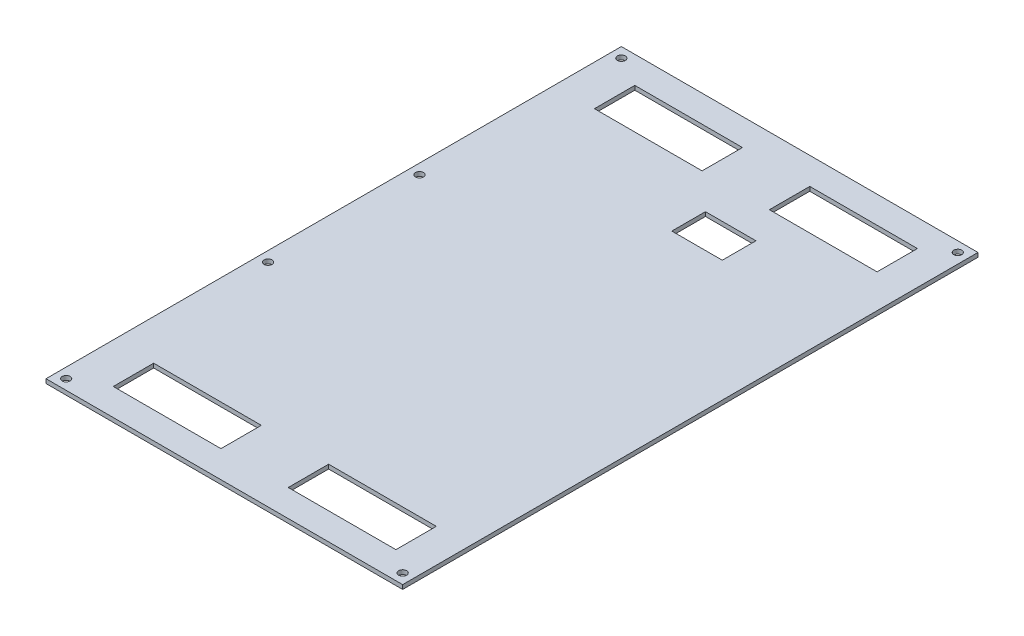
ISO-10303-21;
HEADER;
FILE_DESCRIPTION(('STEP AP214'),'2;1');
FILE_NAME('part.step','',(''),(''),'','','');
FILE_SCHEMA(('AUTOMOTIVE_DESIGN { 1 0 10303 214 1 1 1 1 }'));
ENDSEC;
DATA;
#1=APPLICATION_CONTEXT('core data for automotive mechanical design processes');
#2=APPLICATION_PROTOCOL_DEFINITION('international standard','automotive_design',2000,#1);
#3=PRODUCT_CONTEXT('',#1,'mechanical');
#4=PRODUCT('Part','Part','',(#3));
#5=PRODUCT_RELATED_PRODUCT_CATEGORY('part','',(#4));
#6=PRODUCT_DEFINITION_FORMATION('','',#4);
#7=PRODUCT_DEFINITION_CONTEXT('part definition',#1,'design');
#8=PRODUCT_DEFINITION('design','',#6,#7);
#9=PRODUCT_DEFINITION_SHAPE('','',#8);
#10=(LENGTH_UNIT() NAMED_UNIT(*) SI_UNIT(.MILLI.,.METRE.));
#11=(NAMED_UNIT(*) PLANE_ANGLE_UNIT() SI_UNIT($,.RADIAN.));
#12=(NAMED_UNIT(*) SI_UNIT($,.STERADIAN.) SOLID_ANGLE_UNIT());
#13=UNCERTAINTY_MEASURE_WITH_UNIT(LENGTH_MEASURE(1.E-05),#10,'distance_accuracy_value','');
#14=(GEOMETRIC_REPRESENTATION_CONTEXT(3) GLOBAL_UNCERTAINTY_ASSIGNED_CONTEXT((#13)) GLOBAL_UNIT_ASSIGNED_CONTEXT((#10,
#11,#12)) REPRESENTATION_CONTEXT('',''));
#15=CARTESIAN_POINT('',(0.,0.,0.));
#16=DIRECTION('',(0.,0.,1.));
#17=DIRECTION('',(1.,0.,0.));
#18=AXIS2_PLACEMENT_3D('',#15,#16,#17);
#19=CARTESIAN_POINT('',(0.,-1.5875,0.));
#20=DIRECTION('',(-1.,0.,0.));
#21=DIRECTION('',(0.,0.,1.));
#22=AXIS2_PLACEMENT_3D('',#19,#20,#21);
#23=PLANE('',#22);
#24=DIRECTION('',(0.,0.,1.));
#25=VECTOR('',#24,1.);
#26=CARTESIAN_POINT('',(0.,0.,0.));
#27=LINE('',#26,#25);
#28=CARTESIAN_POINT('',(0.,0.,-217.17));
#29=VERTEX_POINT('',#28);
#30=CARTESIAN_POINT('',(0.,0.,0.));
#31=VERTEX_POINT('',#30);
#32=EDGE_CURVE('E324',#29,#31,#27,.T.);
#33=ORIENTED_EDGE('',*,*,#32,.F.);
#34=DIRECTION('',(0.,1.,0.));
#35=VECTOR('',#34,1.);
#36=CARTESIAN_POINT('',(0.,-1.5875,-217.17));
#37=LINE('',#36,#35);
#38=CARTESIAN_POINT('',(0.,-1.5875,-217.17));
#39=VERTEX_POINT('',#38);
#40=EDGE_CURVE('E355',#39,#29,#37,.T.);
#41=ORIENTED_EDGE('',*,*,#40,.F.);
#42=DIRECTION('',(0.,0.,1.));
#43=VECTOR('',#42,1.);
#44=CARTESIAN_POINT('',(0.,-1.5875,0.));
#45=LINE('',#44,#43);
#46=CARTESIAN_POINT('',(0.,-1.5875,0.));
#47=VERTEX_POINT('',#46);
#48=EDGE_CURVE('E331',#39,#47,#45,.T.);
#49=ORIENTED_EDGE('',*,*,#48,.T.);
#50=DIRECTION('',(0.,1.,0.));
#51=VECTOR('',#50,1.);
#52=CARTESIAN_POINT('',(0.,-1.5875,0.));
#53=LINE('',#52,#51);
#54=EDGE_CURVE('E344',#47,#31,#53,.T.);
#55=ORIENTED_EDGE('',*,*,#54,.T.);
#56=EDGE_LOOP('',(#33,#41,#49,#55));
#57=FACE_BOUND('',#56,.T.);
#58=ADVANCED_FACE('F36',(#57),#23,.T.);
#59=CARTESIAN_POINT('',(0.,-1.5875,-217.17));
#60=DIRECTION('',(0.,0.,-1.));
#61=DIRECTION('',(-1.,0.,0.));
#62=AXIS2_PLACEMENT_3D('',#59,#60,#61);
#63=PLANE('',#62);
#64=DIRECTION('',(-1.,0.,0.));
#65=VECTOR('',#64,1.);
#66=CARTESIAN_POINT('',(0.,0.,-217.17));
#67=LINE('',#66,#65);
#68=CARTESIAN_POINT('',(134.62,0.,-217.17));
#69=VERTEX_POINT('',#68);
#70=EDGE_CURVE('E335',#69,#29,#67,.T.);
#71=ORIENTED_EDGE('',*,*,#70,.F.);
#72=DIRECTION('',(0.,1.,0.));
#73=VECTOR('',#72,1.);
#74=CARTESIAN_POINT('',(134.62,-1.5875,-217.17));
#75=LINE('',#74,#73);
#76=CARTESIAN_POINT('',(134.62,-1.5875,-217.17));
#77=VERTEX_POINT('',#76);
#78=EDGE_CURVE('E358',#77,#69,#75,.T.);
#79=ORIENTED_EDGE('',*,*,#78,.F.);
#80=DIRECTION('',(-1.,0.,0.));
#81=VECTOR('',#80,1.);
#82=CARTESIAN_POINT('',(0.,-1.5875,-217.17));
#83=LINE('',#82,#81);
#84=EDGE_CURVE('E341',#77,#39,#83,.T.);
#85=ORIENTED_EDGE('',*,*,#84,.T.);
#86=ORIENTED_EDGE('',*,*,#40,.T.);
#87=EDGE_LOOP('',(#71,#79,#85,#86));
#88=FACE_BOUND('',#87,.T.);
#89=ADVANCED_FACE('F443',(#88),#63,.T.);
#90=CARTESIAN_POINT('',(134.62,-1.5875,0.));
#91=DIRECTION('',(1.,0.,0.));
#92=DIRECTION('',(0.,0.,-1.));
#93=AXIS2_PLACEMENT_3D('',#90,#91,#92);
#94=PLANE('',#93);
#95=DIRECTION('',(0.,0.,-1.));
#96=VECTOR('',#95,1.);
#97=CARTESIAN_POINT('',(134.62,0.,0.));
#98=LINE('',#97,#96);
#99=CARTESIAN_POINT('',(134.62,0.,0.));
#100=VERTEX_POINT('',#99);
#101=EDGE_CURVE('E350',#100,#69,#98,.T.);
#102=ORIENTED_EDGE('',*,*,#101,.F.);
#103=DIRECTION('',(0.,1.,0.));
#104=VECTOR('',#103,1.);
#105=CARTESIAN_POINT('',(134.62,-1.5875,0.));
#106=LINE('',#105,#104);
#107=CARTESIAN_POINT('',(134.62,-1.5875,0.));
#108=VERTEX_POINT('',#107);
#109=EDGE_CURVE('E360',#108,#100,#106,.T.);
#110=ORIENTED_EDGE('',*,*,#109,.F.);
#111=DIRECTION('',(0.,0.,-1.));
#112=VECTOR('',#111,1.);
#113=CARTESIAN_POINT('',(134.62,-1.5875,0.));
#114=LINE('',#113,#112);
#115=EDGE_CURVE('E338',#108,#77,#114,.T.);
#116=ORIENTED_EDGE('',*,*,#115,.T.);
#117=ORIENTED_EDGE('',*,*,#78,.T.);
#118=EDGE_LOOP('',(#102,#110,#116,#117));
#119=FACE_BOUND('',#118,.T.);
#120=ADVANCED_FACE('F448',(#119),#94,.T.);
#121=CARTESIAN_POINT('',(0.,-1.5875,0.));
#122=DIRECTION('',(0.,0.,1.));
#123=DIRECTION('',(1.,0.,0.));
#124=AXIS2_PLACEMENT_3D('',#121,#122,#123);
#125=PLANE('',#124);
#126=DIRECTION('',(1.,0.,0.));
#127=VECTOR('',#126,1.);
#128=CARTESIAN_POINT('',(0.,0.,0.));
#129=LINE('',#128,#127);
#130=EDGE_CURVE('E347',#31,#100,#129,.T.);
#131=ORIENTED_EDGE('',*,*,#130,.F.);
#132=ORIENTED_EDGE('',*,*,#54,.F.);
#133=DIRECTION('',(1.,0.,0.));
#134=VECTOR('',#133,1.);
#135=CARTESIAN_POINT('',(0.,-1.5875,0.));
#136=LINE('',#135,#134);
#137=EDGE_CURVE('E334',#47,#108,#136,.T.);
#138=ORIENTED_EDGE('',*,*,#137,.T.);
#139=ORIENTED_EDGE('',*,*,#109,.T.);
#140=EDGE_LOOP('',(#131,#132,#138,#139));
#141=FACE_BOUND('',#140,.T.);
#142=ADVANCED_FACE('F462',(#141),#125,.T.);
#143=CARTESIAN_POINT('',(0.,-1.5875,0.));
#144=DIRECTION('',(0.,-1.,0.));
#145=DIRECTION('',(0.,0.,-1.));
#146=AXIS2_PLACEMENT_3D('',#143,#144,#145);
#147=PLANE('',#146);
#148=CARTESIAN_POINT('',(130.81,-1.5875,-3.81));
#149=DIRECTION('',(0.,-1.,0.));
#150=DIRECTION('',(0.,0.,-1.));
#151=AXIS2_PLACEMENT_3D('',#148,#149,#150);
#152=CIRCLE('',#151,1.5);
#153=CARTESIAN_POINT('',(130.81,-1.5875,-5.31));
#154=VERTEX_POINT('',#153);
#155=EDGE_CURVE('E228',#154,#154,#152,.T.);
#156=ORIENTED_EDGE('',*,*,#155,.F.);
#157=EDGE_LOOP('',(#156));
#158=FACE_BOUND('',#157,.T.);
#159=DIRECTION('',(0.,0.,-1.));
#160=VECTOR('',#159,1.);
#161=CARTESIAN_POINT('',(69.85,-1.5875,-166.37));
#162=LINE('',#161,#160);
#163=CARTESIAN_POINT('',(69.85,-1.5875,-166.37));
#164=VERTEX_POINT('',#163);
#165=CARTESIAN_POINT('',(69.85,-1.5875,-179.07));
#166=VERTEX_POINT('',#165);
#167=EDGE_CURVE('E50',#164,#166,#162,.T.);
#168=ORIENTED_EDGE('',*,*,#167,.F.);
#169=DIRECTION('',(-1.,0.,0.));
#170=VECTOR('',#169,1.);
#171=CARTESIAN_POINT('',(69.85,-1.5875,-166.37));
#172=LINE('',#171,#170);
#173=CARTESIAN_POINT('',(88.9,-1.5875,-166.37));
#174=VERTEX_POINT('',#173);
#175=EDGE_CURVE('E215',#174,#164,#172,.T.);
#176=ORIENTED_EDGE('',*,*,#175,.F.);
#177=DIRECTION('',(0.,0.,1.));
#178=VECTOR('',#177,1.);
#179=CARTESIAN_POINT('',(88.9,-1.5875,-166.37));
#180=LINE('',#179,#178);
#181=CARTESIAN_POINT('',(88.9,-1.5875,-179.07));
#182=VERTEX_POINT('',#181);
#183=EDGE_CURVE('E199',#182,#174,#180,.T.);
#184=ORIENTED_EDGE('',*,*,#183,.F.);
#185=DIRECTION('',(1.,0.,0.));
#186=VECTOR('',#185,1.);
#187=CARTESIAN_POINT('',(69.85,-1.5875,-179.07));
#188=LINE('',#187,#186);
#189=EDGE_CURVE('E208',#166,#182,#188,.T.);
#190=ORIENTED_EDGE('',*,*,#189,.F.);
#191=EDGE_LOOP('',(#168,#176,#184,#190));
#192=FACE_BOUND('',#191,.T.);
#193=CARTESIAN_POINT('',(130.81,-1.5875,-213.36));
#194=DIRECTION('',(0.,-1.,0.));
#195=DIRECTION('',(0.,0.,-1.));
#196=AXIS2_PLACEMENT_3D('',#193,#194,#195);
#197=CIRCLE('',#196,1.5);
#198=CARTESIAN_POINT('',(130.81,-1.5875,-214.86));
#199=VERTEX_POINT('',#198);
#200=EDGE_CURVE('E222',#199,#199,#197,.T.);
#201=ORIENTED_EDGE('',*,*,#200,.F.);
#202=EDGE_LOOP('',(#201));
#203=FACE_BOUND('',#202,.T.);
#204=CARTESIAN_POINT('',(3.81,-1.5875,-213.36));
#205=DIRECTION('',(0.,-1.,0.));
#206=DIRECTION('',(0.,0.,-1.));
#207=AXIS2_PLACEMENT_3D('',#204,#205,#206);
#208=CIRCLE('',#207,1.49999999999999);
#209=CARTESIAN_POINT('',(3.81,-1.5875,-214.86));
#210=VERTEX_POINT('',#209);
#211=EDGE_CURVE('E232',#210,#210,#208,.T.);
#212=ORIENTED_EDGE('',*,*,#211,.F.);
#213=EDGE_LOOP('',(#212));
#214=FACE_BOUND('',#213,.T.);
#215=CARTESIAN_POINT('',(3.81,-1.5875,-137.16));
#216=DIRECTION('',(0.,-1.,0.));
#217=DIRECTION('',(0.,0.,-1.));
#218=AXIS2_PLACEMENT_3D('',#215,#216,#217);
#219=CIRCLE('',#218,1.49999999999999);
#220=CARTESIAN_POINT('',(3.81,-1.5875,-138.66));
#221=VERTEX_POINT('',#220);
#222=EDGE_CURVE('E236',#221,#221,#219,.T.);
#223=ORIENTED_EDGE('',*,*,#222,.F.);
#224=EDGE_LOOP('',(#223));
#225=FACE_BOUND('',#224,.T.);
#226=CARTESIAN_POINT('',(3.81,-1.5875,-80.01));
#227=DIRECTION('',(0.,-1.,0.));
#228=DIRECTION('',(0.,0.,-1.));
#229=AXIS2_PLACEMENT_3D('',#226,#227,#228);
#230=CIRCLE('',#229,1.49999999999999);
#231=CARTESIAN_POINT('',(3.81,-1.5875,-81.51));
#232=VERTEX_POINT('',#231);
#233=EDGE_CURVE('E240',#232,#232,#230,.T.);
#234=ORIENTED_EDGE('',*,*,#233,.F.);
#235=EDGE_LOOP('',(#234));
#236=FACE_BOUND('',#235,.T.);
#237=CARTESIAN_POINT('',(3.81,-1.5875,-3.81));
#238=DIRECTION('',(0.,-1.,0.));
#239=DIRECTION('',(0.,0.,-1.));
#240=AXIS2_PLACEMENT_3D('',#237,#238,#239);
#241=CIRCLE('',#240,1.49999999999999);
#242=CARTESIAN_POINT('',(3.81,-1.5875,-5.30999999999999));
#243=VERTEX_POINT('',#242);
#244=EDGE_CURVE('E246',#243,#243,#241,.T.);
#245=ORIENTED_EDGE('',*,*,#244,.F.);
#246=EDGE_LOOP('',(#245));
#247=FACE_BOUND('',#246,.T.);
#248=DIRECTION('',(-1.,0.,0.));
#249=VECTOR('',#248,1.);
#250=CARTESIAN_POINT('',(55.88,-1.5875,-191.77));
#251=LINE('',#250,#249);
#252=CARTESIAN_POINT('',(55.88,-1.5875,-191.77));
#253=VERTEX_POINT('',#252);
#254=CARTESIAN_POINT('',(15.24,-1.5875,-191.77));
#255=VERTEX_POINT('',#254);
#256=EDGE_CURVE('E250',#253,#255,#251,.T.);
#257=ORIENTED_EDGE('',*,*,#256,.F.);
#258=DIRECTION('',(0.,0.,1.));
#259=VECTOR('',#258,1.);
#260=CARTESIAN_POINT('',(55.88,-1.5875,-191.77));
#261=LINE('',#260,#259);
#262=CARTESIAN_POINT('',(55.88,-1.5875,-207.01));
#263=VERTEX_POINT('',#262);
#264=EDGE_CURVE('E258',#263,#253,#261,.T.);
#265=ORIENTED_EDGE('',*,*,#264,.F.);
#266=DIRECTION('',(1.,0.,0.));
#267=VECTOR('',#266,1.);
#268=CARTESIAN_POINT('',(55.88,-1.5875,-207.01));
#269=LINE('',#268,#267);
#270=CARTESIAN_POINT('',(15.24,-1.5875,-207.01));
#271=VERTEX_POINT('',#270);
#272=EDGE_CURVE('E255',#271,#263,#269,.T.);
#273=ORIENTED_EDGE('',*,*,#272,.F.);
#274=DIRECTION('',(0.,0.,-1.));
#275=VECTOR('',#274,1.);
#276=CARTESIAN_POINT('',(15.24,-1.5875,-191.77));
#277=LINE('',#276,#275);
#278=EDGE_CURVE('E252',#255,#271,#277,.T.);
#279=ORIENTED_EDGE('',*,*,#278,.F.);
#280=EDGE_LOOP('',(#257,#265,#273,#279));
#281=FACE_BOUND('',#280,.T.);
#282=DIRECTION('',(-1.,0.,0.));
#283=VECTOR('',#282,1.);
#284=CARTESIAN_POINT('',(121.92,-1.5875,-191.77));
#285=LINE('',#284,#283);
#286=CARTESIAN_POINT('',(121.92,-1.5875,-191.77));
#287=VERTEX_POINT('',#286);
#288=CARTESIAN_POINT('',(81.28,-1.5875,-191.77));
#289=VERTEX_POINT('',#288);
#290=EDGE_CURVE('E264',#287,#289,#285,.T.);
#291=ORIENTED_EDGE('',*,*,#290,.F.);
#292=DIRECTION('',(0.,0.,1.));
#293=VECTOR('',#292,1.);
#294=CARTESIAN_POINT('',(121.92,-1.5875,-191.77));
#295=LINE('',#294,#293);
#296=CARTESIAN_POINT('',(121.92,-1.5875,-207.01));
#297=VERTEX_POINT('',#296);
#298=EDGE_CURVE('E278',#297,#287,#295,.T.);
#299=ORIENTED_EDGE('',*,*,#298,.F.);
#300=DIRECTION('',(1.,0.,0.));
#301=VECTOR('',#300,1.);
#302=CARTESIAN_POINT('',(121.92,-1.5875,-207.01));
#303=LINE('',#302,#301);
#304=CARTESIAN_POINT('',(81.28,-1.5875,-207.01));
#305=VERTEX_POINT('',#304);
#306=EDGE_CURVE('E275',#305,#297,#303,.T.);
#307=ORIENTED_EDGE('',*,*,#306,.F.);
#308=DIRECTION('',(0.,0.,-1.));
#309=VECTOR('',#308,1.);
#310=CARTESIAN_POINT('',(81.28,-1.5875,-191.77));
#311=LINE('',#310,#309);
#312=EDGE_CURVE('E272',#289,#305,#311,.T.);
#313=ORIENTED_EDGE('',*,*,#312,.F.);
#314=EDGE_LOOP('',(#291,#299,#307,#313));
#315=FACE_BOUND('',#314,.T.);
#316=DIRECTION('',(-1.,0.,0.));
#317=VECTOR('',#316,1.);
#318=CARTESIAN_POINT('',(55.88,-1.5875,-10.16));
#319=LINE('',#318,#317);
#320=CARTESIAN_POINT('',(55.88,-1.5875,-10.16));
#321=VERTEX_POINT('',#320);
#322=CARTESIAN_POINT('',(15.24,-1.5875,-10.16));
#323=VERTEX_POINT('',#322);
#324=EDGE_CURVE('E284',#321,#323,#319,.T.);
#325=ORIENTED_EDGE('',*,*,#324,.F.);
#326=DIRECTION('',(0.,0.,1.));
#327=VECTOR('',#326,1.);
#328=CARTESIAN_POINT('',(55.88,-1.5875,-10.16));
#329=LINE('',#328,#327);
#330=CARTESIAN_POINT('',(55.88,-1.5875,-25.4));
#331=VERTEX_POINT('',#330);
#332=EDGE_CURVE('E298',#331,#321,#329,.T.);
#333=ORIENTED_EDGE('',*,*,#332,.F.);
#334=DIRECTION('',(1.,0.,0.));
#335=VECTOR('',#334,1.);
#336=CARTESIAN_POINT('',(55.88,-1.5875,-25.4));
#337=LINE('',#336,#335);
#338=CARTESIAN_POINT('',(15.24,-1.5875,-25.4));
#339=VERTEX_POINT('',#338);
#340=EDGE_CURVE('E295',#339,#331,#337,.T.);
#341=ORIENTED_EDGE('',*,*,#340,.F.);
#342=DIRECTION('',(0.,0.,-1.));
#343=VECTOR('',#342,1.);
#344=CARTESIAN_POINT('',(15.24,-1.5875,-10.16));
#345=LINE('',#344,#343);
#346=EDGE_CURVE('E292',#323,#339,#345,.T.);
#347=ORIENTED_EDGE('',*,*,#346,.F.);
#348=EDGE_LOOP('',(#325,#333,#341,#347));
#349=FACE_BOUND('',#348,.T.);
#350=DIRECTION('',(-1.,0.,0.));
#351=VECTOR('',#350,1.);
#352=CARTESIAN_POINT('',(121.92,-1.5875,-10.16));
#353=LINE('',#352,#351);
#354=CARTESIAN_POINT('',(121.92,-1.5875,-10.16));
#355=VERTEX_POINT('',#354);
#356=CARTESIAN_POINT('',(81.28,-1.5875,-10.16));
#357=VERTEX_POINT('',#356);
#358=EDGE_CURVE('E304',#355,#357,#353,.T.);
#359=ORIENTED_EDGE('',*,*,#358,.F.);
#360=DIRECTION('',(0.,0.,1.));
#361=VECTOR('',#360,1.);
#362=CARTESIAN_POINT('',(121.92,-1.5875,-10.16));
#363=LINE('',#362,#361);
#364=CARTESIAN_POINT('',(121.92,-1.5875,-25.4));
#365=VERTEX_POINT('',#364);
#366=EDGE_CURVE('E318',#365,#355,#363,.T.);
#367=ORIENTED_EDGE('',*,*,#366,.F.);
#368=DIRECTION('',(1.,0.,0.));
#369=VECTOR('',#368,1.);
#370=CARTESIAN_POINT('',(121.92,-1.5875,-25.4));
#371=LINE('',#370,#369);
#372=CARTESIAN_POINT('',(81.28,-1.5875,-25.4));
#373=VERTEX_POINT('',#372);
#374=EDGE_CURVE('E315',#373,#365,#371,.T.);
#375=ORIENTED_EDGE('',*,*,#374,.F.);
#376=DIRECTION('',(0.,0.,-1.));
#377=VECTOR('',#376,1.);
#378=CARTESIAN_POINT('',(81.28,-1.5875,-10.16));
#379=LINE('',#378,#377);
#380=EDGE_CURVE('E312',#357,#373,#379,.T.);
#381=ORIENTED_EDGE('',*,*,#380,.F.);
#382=EDGE_LOOP('',(#359,#367,#375,#381));
#383=FACE_BOUND('',#382,.T.);
#384=ORIENTED_EDGE('',*,*,#48,.F.);
#385=ORIENTED_EDGE('',*,*,#84,.F.);
#386=ORIENTED_EDGE('',*,*,#115,.F.);
#387=ORIENTED_EDGE('',*,*,#137,.F.);
#388=EDGE_LOOP('',(#384,#385,#386,#387));
#389=FACE_BOUND('',#388,.T.);
#390=ADVANCED_FACE('F212',(#158,#192,#203,#214,#225,#236,#247,#281,#315,#349,#383,#389),#147,.T.);
#391=CARTESIAN_POINT('',(0.,0.,0.));
#392=DIRECTION('',(0.,-1.,0.));
#393=DIRECTION('',(0.,0.,-1.));
#394=AXIS2_PLACEMENT_3D('',#391,#392,#393);
#395=PLANE('',#394);
#396=DIRECTION('',(-1.,0.,0.));
#397=VECTOR('',#396,1.);
#398=CARTESIAN_POINT('',(0.,0.,-166.37));
#399=LINE('',#398,#397);
#400=CARTESIAN_POINT('',(88.9,0.,-166.37));
#401=VERTEX_POINT('',#400);
#402=CARTESIAN_POINT('',(69.85,0.,-166.37));
#403=VERTEX_POINT('',#402);
#404=EDGE_CURVE('E43',#401,#403,#399,.T.);
#405=ORIENTED_EDGE('',*,*,#404,.T.);
#406=DIRECTION('',(0.,0.,-1.));
#407=VECTOR('',#406,1.);
#408=CARTESIAN_POINT('',(69.85,0.,0.));
#409=LINE('',#408,#407);
#410=CARTESIAN_POINT('',(69.85,0.,-179.07));
#411=VERTEX_POINT('',#410);
#412=EDGE_CURVE('E11',#403,#411,#409,.T.);
#413=ORIENTED_EDGE('',*,*,#412,.T.);
#414=DIRECTION('',(1.,0.,0.));
#415=VECTOR('',#414,1.);
#416=CARTESIAN_POINT('',(0.,0.,-179.07));
#417=LINE('',#416,#415);
#418=CARTESIAN_POINT('',(88.9,0.,-179.07));
#419=VERTEX_POINT('',#418);
#420=EDGE_CURVE('E410',#411,#419,#417,.T.);
#421=ORIENTED_EDGE('',*,*,#420,.T.);
#422=DIRECTION('',(0.,0.,1.));
#423=VECTOR('',#422,1.);
#424=CARTESIAN_POINT('',(88.9,0.,0.));
#425=LINE('',#424,#423);
#426=EDGE_CURVE('E202',#419,#401,#425,.T.);
#427=ORIENTED_EDGE('',*,*,#426,.T.);
#428=EDGE_LOOP('',(#405,#413,#421,#427));
#429=FACE_BOUND('',#428,.T.);
#430=CARTESIAN_POINT('',(130.81,0.,-213.36));
#431=DIRECTION('',(0.,-1.,0.));
#432=DIRECTION('',(0.,0.,-1.));
#433=AXIS2_PLACEMENT_3D('',#430,#431,#432);
#434=CIRCLE('',#433,1.5);
#435=CARTESIAN_POINT('',(130.81,0.,-214.86));
#436=VERTEX_POINT('',#435);
#437=EDGE_CURVE('E227',#436,#436,#434,.T.);
#438=ORIENTED_EDGE('',*,*,#437,.T.);
#439=EDGE_LOOP('',(#438));
#440=FACE_BOUND('',#439,.T.);
#441=CARTESIAN_POINT('',(130.81,0.,-3.81));
#442=DIRECTION('',(0.,-1.,0.));
#443=DIRECTION('',(0.,0.,-1.));
#444=AXIS2_PLACEMENT_3D('',#441,#442,#443);
#445=CIRCLE('',#444,1.5);
#446=CARTESIAN_POINT('',(130.81,0.,-5.31));
#447=VERTEX_POINT('',#446);
#448=EDGE_CURVE('E231',#447,#447,#445,.T.);
#449=ORIENTED_EDGE('',*,*,#448,.T.);
#450=EDGE_LOOP('',(#449));
#451=FACE_BOUND('',#450,.T.);
#452=CARTESIAN_POINT('',(3.81,0.,-213.36));
#453=DIRECTION('',(0.,-1.,0.));
#454=DIRECTION('',(0.,0.,-1.));
#455=AXIS2_PLACEMENT_3D('',#452,#453,#454);
#456=CIRCLE('',#455,1.49999999999999);
#457=CARTESIAN_POINT('',(3.81,0.,-214.86));
#458=VERTEX_POINT('',#457);
#459=EDGE_CURVE('E235',#458,#458,#456,.T.);
#460=ORIENTED_EDGE('',*,*,#459,.T.);
#461=EDGE_LOOP('',(#460));
#462=FACE_BOUND('',#461,.T.);
#463=CARTESIAN_POINT('',(3.81,0.,-137.16));
#464=DIRECTION('',(0.,-1.,0.));
#465=DIRECTION('',(0.,0.,-1.));
#466=AXIS2_PLACEMENT_3D('',#463,#464,#465);
#467=CIRCLE('',#466,1.49999999999999);
#468=CARTESIAN_POINT('',(3.81,0.,-138.66));
#469=VERTEX_POINT('',#468);
#470=EDGE_CURVE('E239',#469,#469,#467,.T.);
#471=ORIENTED_EDGE('',*,*,#470,.T.);
#472=EDGE_LOOP('',(#471));
#473=FACE_BOUND('',#472,.T.);
#474=CARTESIAN_POINT('',(3.81,0.,-80.01));
#475=DIRECTION('',(0.,-1.,0.));
#476=DIRECTION('',(0.,0.,-1.));
#477=AXIS2_PLACEMENT_3D('',#474,#475,#476);
#478=CIRCLE('',#477,1.49999999999999);
#479=CARTESIAN_POINT('',(3.81,0.,-81.51));
#480=VERTEX_POINT('',#479);
#481=EDGE_CURVE('E243',#480,#480,#478,.T.);
#482=ORIENTED_EDGE('',*,*,#481,.T.);
#483=EDGE_LOOP('',(#482));
#484=FACE_BOUND('',#483,.T.);
#485=CARTESIAN_POINT('',(3.81,0.,-3.81));
#486=DIRECTION('',(0.,-1.,0.));
#487=DIRECTION('',(0.,0.,-1.));
#488=AXIS2_PLACEMENT_3D('',#485,#486,#487);
#489=CIRCLE('',#488,1.49999999999999);
#490=CARTESIAN_POINT('',(3.81,0.,-5.30999999999999));
#491=VERTEX_POINT('',#490);
#492=EDGE_CURVE('E249',#491,#491,#489,.T.);
#493=ORIENTED_EDGE('',*,*,#492,.T.);
#494=EDGE_LOOP('',(#493));
#495=FACE_BOUND('',#494,.T.);
#496=DIRECTION('',(0.,0.,1.));
#497=VECTOR('',#496,1.);
#498=CARTESIAN_POINT('',(55.88,0.,0.));
#499=LINE('',#498,#497);
#500=CARTESIAN_POINT('',(55.88,0.,-207.01));
#501=VERTEX_POINT('',#500);
#502=CARTESIAN_POINT('',(55.88,0.,-191.77));
#503=VERTEX_POINT('',#502);
#504=EDGE_CURVE('E404',#501,#503,#499,.T.);
#505=ORIENTED_EDGE('',*,*,#504,.T.);
#506=DIRECTION('',(-1.,0.,0.));
#507=VECTOR('',#506,1.);
#508=CARTESIAN_POINT('',(-1.30971622436249E-13,0.,-191.77));
#509=LINE('',#508,#507);
#510=CARTESIAN_POINT('',(15.24,0.,-191.77));
#511=VERTEX_POINT('',#510);
#512=EDGE_CURVE('E407',#503,#511,#509,.T.);
#513=ORIENTED_EDGE('',*,*,#512,.T.);
#514=DIRECTION('',(0.,0.,-1.));
#515=VECTOR('',#514,1.);
#516=CARTESIAN_POINT('',(15.24,0.,0.));
#517=LINE('',#516,#515);
#518=CARTESIAN_POINT('',(15.24,0.,-207.01));
#519=VERTEX_POINT('',#518);
#520=EDGE_CURVE('E398',#511,#519,#517,.T.);
#521=ORIENTED_EDGE('',*,*,#520,.T.);
#522=DIRECTION('',(1.,0.,0.));
#523=VECTOR('',#522,1.);
#524=CARTESIAN_POINT('',(0.,0.,-207.01));
#525=LINE('',#524,#523);
#526=EDGE_CURVE('E401',#519,#501,#525,.T.);
#527=ORIENTED_EDGE('',*,*,#526,.T.);
#528=EDGE_LOOP('',(#505,#513,#521,#527));
#529=FACE_BOUND('',#528,.T.);
#530=DIRECTION('',(0.,0.,1.));
#531=VECTOR('',#530,1.);
#532=CARTESIAN_POINT('',(121.92,0.,0.));
#533=LINE('',#532,#531);
#534=CARTESIAN_POINT('',(121.92,0.,-207.01));
#535=VERTEX_POINT('',#534);
#536=CARTESIAN_POINT('',(121.92,0.,-191.77));
#537=VERTEX_POINT('',#536);
#538=EDGE_CURVE('E392',#535,#537,#533,.T.);
#539=ORIENTED_EDGE('',*,*,#538,.T.);
#540=DIRECTION('',(-1.,0.,0.));
#541=VECTOR('',#540,1.);
#542=CARTESIAN_POINT('',(0.,0.,-191.77));
#543=LINE('',#542,#541);
#544=CARTESIAN_POINT('',(81.28,0.,-191.77));
#545=VERTEX_POINT('',#544);
#546=EDGE_CURVE('E395',#537,#545,#543,.T.);
#547=ORIENTED_EDGE('',*,*,#546,.T.);
#548=DIRECTION('',(0.,0.,-1.));
#549=VECTOR('',#548,1.);
#550=CARTESIAN_POINT('',(81.28,0.,0.));
#551=LINE('',#550,#549);
#552=CARTESIAN_POINT('',(81.28,0.,-207.01));
#553=VERTEX_POINT('',#552);
#554=EDGE_CURVE('E386',#545,#553,#551,.T.);
#555=ORIENTED_EDGE('',*,*,#554,.T.);
#556=DIRECTION('',(1.,0.,0.));
#557=VECTOR('',#556,1.);
#558=CARTESIAN_POINT('',(0.,0.,-207.01));
#559=LINE('',#558,#557);
#560=EDGE_CURVE('E389',#553,#535,#559,.T.);
#561=ORIENTED_EDGE('',*,*,#560,.T.);
#562=EDGE_LOOP('',(#539,#547,#555,#561));
#563=FACE_BOUND('',#562,.T.);
#564=DIRECTION('',(0.,0.,1.));
#565=VECTOR('',#564,1.);
#566=CARTESIAN_POINT('',(55.88,0.,0.));
#567=LINE('',#566,#565);
#568=CARTESIAN_POINT('',(55.88,0.,-25.4));
#569=VERTEX_POINT('',#568);
#570=CARTESIAN_POINT('',(55.88,0.,-10.16));
#571=VERTEX_POINT('',#570);
#572=EDGE_CURVE('E380',#569,#571,#567,.T.);
#573=ORIENTED_EDGE('',*,*,#572,.T.);
#574=DIRECTION('',(-1.,0.,0.));
#575=VECTOR('',#574,1.);
#576=CARTESIAN_POINT('',(0.,0.,-10.16));
#577=LINE('',#576,#575);
#578=CARTESIAN_POINT('',(15.24,0.,-10.16));
#579=VERTEX_POINT('',#578);
#580=EDGE_CURVE('E383',#571,#579,#577,.T.);
#581=ORIENTED_EDGE('',*,*,#580,.T.);
#582=DIRECTION('',(0.,0.,-1.));
#583=VECTOR('',#582,1.);
#584=CARTESIAN_POINT('',(15.24,0.,0.));
#585=LINE('',#584,#583);
#586=CARTESIAN_POINT('',(15.24,0.,-25.4));
#587=VERTEX_POINT('',#586);
#588=EDGE_CURVE('E374',#579,#587,#585,.T.);
#589=ORIENTED_EDGE('',*,*,#588,.T.);
#590=DIRECTION('',(1.,0.,0.));
#591=VECTOR('',#590,1.);
#592=CARTESIAN_POINT('',(0.,0.,-25.4));
#593=LINE('',#592,#591);
#594=EDGE_CURVE('E377',#587,#569,#593,.T.);
#595=ORIENTED_EDGE('',*,*,#594,.T.);
#596=EDGE_LOOP('',(#573,#581,#589,#595));
#597=FACE_BOUND('',#596,.T.);
#598=DIRECTION('',(0.,0.,1.));
#599=VECTOR('',#598,1.);
#600=CARTESIAN_POINT('',(121.92,0.,1.11022302462516E-13));
#601=LINE('',#600,#599);
#602=CARTESIAN_POINT('',(121.92,0.,-25.4));
#603=VERTEX_POINT('',#602);
#604=CARTESIAN_POINT('',(121.92,0.,-10.16));
#605=VERTEX_POINT('',#604);
#606=EDGE_CURVE('E368',#603,#605,#601,.T.);
#607=ORIENTED_EDGE('',*,*,#606,.T.);
#608=DIRECTION('',(-1.,0.,0.));
#609=VECTOR('',#608,1.);
#610=CARTESIAN_POINT('',(0.,0.,-10.16));
#611=LINE('',#610,#609);
#612=CARTESIAN_POINT('',(81.28,0.,-10.16));
#613=VERTEX_POINT('',#612);
#614=EDGE_CURVE('E371',#605,#613,#611,.T.);
#615=ORIENTED_EDGE('',*,*,#614,.T.);
#616=DIRECTION('',(0.,0.,-1.));
#617=VECTOR('',#616,1.);
#618=CARTESIAN_POINT('',(81.28,0.,0.));
#619=LINE('',#618,#617);
#620=CARTESIAN_POINT('',(81.28,0.,-25.4));
#621=VERTEX_POINT('',#620);
#622=EDGE_CURVE('E357',#613,#621,#619,.T.);
#623=ORIENTED_EDGE('',*,*,#622,.T.);
#624=DIRECTION('',(1.,0.,0.));
#625=VECTOR('',#624,1.);
#626=CARTESIAN_POINT('',(0.,0.,-25.4));
#627=LINE('',#626,#625);
#628=EDGE_CURVE('E365',#621,#603,#627,.T.);
#629=ORIENTED_EDGE('',*,*,#628,.T.);
#630=EDGE_LOOP('',(#607,#615,#623,#629));
#631=FACE_BOUND('',#630,.T.);
#632=ORIENTED_EDGE('',*,*,#32,.T.);
#633=ORIENTED_EDGE('',*,*,#130,.T.);
#634=ORIENTED_EDGE('',*,*,#101,.T.);
#635=ORIENTED_EDGE('',*,*,#70,.T.);
#636=EDGE_LOOP('',(#632,#633,#634,#635));
#637=FACE_BOUND('',#636,.T.);
#638=ADVANCED_FACE('F424',(#429,#440,#451,#462,#473,#484,#495,#529,#563,#597,#631,#637),#395,.F.);
#639=CARTESIAN_POINT('',(121.92,0.9525,-10.16));
#640=DIRECTION('',(0.,0.,1.));
#641=DIRECTION('',(1.,0.,0.));
#642=AXIS2_PLACEMENT_3D('',#639,#640,#641);
#643=PLANE('',#642);
#644=DIRECTION('',(0.,-1.,0.));
#645=VECTOR('',#644,1.);
#646=CARTESIAN_POINT('',(121.92,0.9525,-10.16));
#647=LINE('',#646,#645);
#648=EDGE_CURVE('E322',#605,#355,#647,.T.);
#649=ORIENTED_EDGE('',*,*,#648,.T.);
#650=ORIENTED_EDGE('',*,*,#358,.T.);
#651=DIRECTION('',(0.,-1.,0.));
#652=VECTOR('',#651,1.);
#653=CARTESIAN_POINT('',(81.28,0.9525,-10.16));
#654=LINE('',#653,#652);
#655=EDGE_CURVE('E321',#613,#357,#654,.T.);
#656=ORIENTED_EDGE('',*,*,#655,.F.);
#657=ORIENTED_EDGE('',*,*,#614,.F.);
#658=EDGE_LOOP('',(#649,#650,#656,#657));
#659=FACE_BOUND('',#658,.T.);
#660=ADVANCED_FACE('F472',(#659),#643,.F.);
#661=CARTESIAN_POINT('',(121.92,0.9525,-10.16));
#662=DIRECTION('',(1.,0.,0.));
#663=DIRECTION('',(0.,0.,-1.));
#664=AXIS2_PLACEMENT_3D('',#661,#662,#663);
#665=PLANE('',#664);
#666=DIRECTION('',(0.,-1.,0.));
#667=VECTOR('',#666,1.);
#668=CARTESIAN_POINT('',(121.92,0.9525,-25.4));
#669=LINE('',#668,#667);
#670=EDGE_CURVE('E325',#603,#365,#669,.T.);
#671=ORIENTED_EDGE('',*,*,#670,.T.);
#672=ORIENTED_EDGE('',*,*,#366,.T.);
#673=ORIENTED_EDGE('',*,*,#648,.F.);
#674=ORIENTED_EDGE('',*,*,#606,.F.);
#675=EDGE_LOOP('',(#671,#672,#673,#674));
#676=FACE_BOUND('',#675,.T.);
#677=ADVANCED_FACE('F478',(#676),#665,.F.);
#678=CARTESIAN_POINT('',(121.92,0.9525,-25.4));
#679=DIRECTION('',(0.,0.,-1.));
#680=DIRECTION('',(-1.,0.,0.));
#681=AXIS2_PLACEMENT_3D('',#678,#679,#680);
#682=PLANE('',#681);
#683=DIRECTION('',(0.,-1.,0.));
#684=VECTOR('',#683,1.);
#685=CARTESIAN_POINT('',(81.28,0.9525,-25.4));
#686=LINE('',#685,#684);
#687=EDGE_CURVE('E327',#621,#373,#686,.T.);
#688=ORIENTED_EDGE('',*,*,#687,.T.);
#689=ORIENTED_EDGE('',*,*,#374,.T.);
#690=ORIENTED_EDGE('',*,*,#670,.F.);
#691=ORIENTED_EDGE('',*,*,#628,.F.);
#692=EDGE_LOOP('',(#688,#689,#690,#691));
#693=FACE_BOUND('',#692,.T.);
#694=ADVANCED_FACE('F484',(#693),#682,.F.);
#695=CARTESIAN_POINT('',(81.28,0.9525,-10.16));
#696=DIRECTION('',(-1.,0.,0.));
#697=DIRECTION('',(0.,0.,1.));
#698=AXIS2_PLACEMENT_3D('',#695,#696,#697);
#699=PLANE('',#698);
#700=ORIENTED_EDGE('',*,*,#655,.T.);
#701=ORIENTED_EDGE('',*,*,#380,.T.);
#702=ORIENTED_EDGE('',*,*,#687,.F.);
#703=ORIENTED_EDGE('',*,*,#622,.F.);
#704=EDGE_LOOP('',(#700,#701,#702,#703));
#705=FACE_BOUND('',#704,.T.);
#706=ADVANCED_FACE('F480',(#705),#699,.F.);
#707=CARTESIAN_POINT('',(55.88,0.9525,-10.16));
#708=DIRECTION('',(0.,0.,1.));
#709=DIRECTION('',(1.,0.,0.));
#710=AXIS2_PLACEMENT_3D('',#707,#708,#709);
#711=PLANE('',#710);
#712=DIRECTION('',(0.,-1.,0.));
#713=VECTOR('',#712,1.);
#714=CARTESIAN_POINT('',(55.88,0.9525,-10.16));
#715=LINE('',#714,#713);
#716=EDGE_CURVE('E302',#571,#321,#715,.T.);
#717=ORIENTED_EDGE('',*,*,#716,.T.);
#718=ORIENTED_EDGE('',*,*,#324,.T.);
#719=DIRECTION('',(0.,-1.,0.));
#720=VECTOR('',#719,1.);
#721=CARTESIAN_POINT('',(15.24,0.9525,-10.16));
#722=LINE('',#721,#720);
#723=EDGE_CURVE('E301',#579,#323,#722,.T.);
#724=ORIENTED_EDGE('',*,*,#723,.F.);
#725=ORIENTED_EDGE('',*,*,#580,.F.);
#726=EDGE_LOOP('',(#717,#718,#724,#725));
#727=FACE_BOUND('',#726,.T.);
#728=ADVANCED_FACE('F483',(#727),#711,.F.);
#729=CARTESIAN_POINT('',(55.88,0.9525,-10.16));
#730=DIRECTION('',(1.,0.,0.));
#731=DIRECTION('',(0.,0.,-1.));
#732=AXIS2_PLACEMENT_3D('',#729,#730,#731);
#733=PLANE('',#732);
#734=DIRECTION('',(0.,-1.,0.));
#735=VECTOR('',#734,1.);
#736=CARTESIAN_POINT('',(55.88,0.9525,-25.4));
#737=LINE('',#736,#735);
#738=EDGE_CURVE('E305',#569,#331,#737,.T.);
#739=ORIENTED_EDGE('',*,*,#738,.T.);
#740=ORIENTED_EDGE('',*,*,#332,.T.);
#741=ORIENTED_EDGE('',*,*,#716,.F.);
#742=ORIENTED_EDGE('',*,*,#572,.F.);
#743=EDGE_LOOP('',(#739,#740,#741,#742));
#744=FACE_BOUND('',#743,.T.);
#745=ADVANCED_FACE('F494',(#744),#733,.F.);
#746=CARTESIAN_POINT('',(55.88,0.9525,-25.4));
#747=DIRECTION('',(0.,0.,-1.));
#748=DIRECTION('',(-1.,0.,0.));
#749=AXIS2_PLACEMENT_3D('',#746,#747,#748);
#750=PLANE('',#749);
#751=DIRECTION('',(0.,-1.,0.));
#752=VECTOR('',#751,1.);
#753=CARTESIAN_POINT('',(15.24,0.9525,-25.4));
#754=LINE('',#753,#752);
#755=EDGE_CURVE('E307',#587,#339,#754,.T.);
#756=ORIENTED_EDGE('',*,*,#755,.T.);
#757=ORIENTED_EDGE('',*,*,#340,.T.);
#758=ORIENTED_EDGE('',*,*,#738,.F.);
#759=ORIENTED_EDGE('',*,*,#594,.F.);
#760=EDGE_LOOP('',(#756,#757,#758,#759));
#761=FACE_BOUND('',#760,.T.);
#762=ADVANCED_FACE('F500',(#761),#750,.F.);
#763=CARTESIAN_POINT('',(15.24,0.9525,-10.16));
#764=DIRECTION('',(-1.,0.,0.));
#765=DIRECTION('',(0.,0.,1.));
#766=AXIS2_PLACEMENT_3D('',#763,#764,#765);
#767=PLANE('',#766);
#768=ORIENTED_EDGE('',*,*,#723,.T.);
#769=ORIENTED_EDGE('',*,*,#346,.T.);
#770=ORIENTED_EDGE('',*,*,#755,.F.);
#771=ORIENTED_EDGE('',*,*,#588,.F.);
#772=EDGE_LOOP('',(#768,#769,#770,#771));
#773=FACE_BOUND('',#772,.T.);
#774=ADVANCED_FACE('F496',(#773),#767,.F.);
#775=CARTESIAN_POINT('',(121.92,0.9525,-191.77));
#776=DIRECTION('',(0.,0.,1.));
#777=DIRECTION('',(1.,0.,0.));
#778=AXIS2_PLACEMENT_3D('',#775,#776,#777);
#779=PLANE('',#778);
#780=DIRECTION('',(0.,-1.,0.));
#781=VECTOR('',#780,1.);
#782=CARTESIAN_POINT('',(121.92,0.9525,-191.77));
#783=LINE('',#782,#781);
#784=EDGE_CURVE('E282',#537,#287,#783,.T.);
#785=ORIENTED_EDGE('',*,*,#784,.T.);
#786=ORIENTED_EDGE('',*,*,#290,.T.);
#787=DIRECTION('',(0.,-1.,0.));
#788=VECTOR('',#787,1.);
#789=CARTESIAN_POINT('',(81.28,0.9525,-191.77));
#790=LINE('',#789,#788);
#791=EDGE_CURVE('E281',#545,#289,#790,.T.);
#792=ORIENTED_EDGE('',*,*,#791,.F.);
#793=ORIENTED_EDGE('',*,*,#546,.F.);
#794=EDGE_LOOP('',(#785,#786,#792,#793));
#795=FACE_BOUND('',#794,.T.);
#796=ADVANCED_FACE('F499',(#795),#779,.F.);
#797=CARTESIAN_POINT('',(121.92,0.9525,-191.77));
#798=DIRECTION('',(1.,0.,0.));
#799=DIRECTION('',(0.,0.,-1.));
#800=AXIS2_PLACEMENT_3D('',#797,#798,#799);
#801=PLANE('',#800);
#802=DIRECTION('',(0.,-1.,0.));
#803=VECTOR('',#802,1.);
#804=CARTESIAN_POINT('',(121.92,0.9525,-207.01));
#805=LINE('',#804,#803);
#806=EDGE_CURVE('E285',#535,#297,#805,.T.);
#807=ORIENTED_EDGE('',*,*,#806,.T.);
#808=ORIENTED_EDGE('',*,*,#298,.T.);
#809=ORIENTED_EDGE('',*,*,#784,.F.);
#810=ORIENTED_EDGE('',*,*,#538,.F.);
#811=EDGE_LOOP('',(#807,#808,#809,#810));
#812=FACE_BOUND('',#811,.T.);
#813=ADVANCED_FACE('F510',(#812),#801,.F.);
#814=CARTESIAN_POINT('',(121.92,0.9525,-207.01));
#815=DIRECTION('',(0.,0.,-1.));
#816=DIRECTION('',(-1.,0.,0.));
#817=AXIS2_PLACEMENT_3D('',#814,#815,#816);
#818=PLANE('',#817);
#819=DIRECTION('',(0.,-1.,0.));
#820=VECTOR('',#819,1.);
#821=CARTESIAN_POINT('',(81.28,0.9525,-207.01));
#822=LINE('',#821,#820);
#823=EDGE_CURVE('E287',#553,#305,#822,.T.);
#824=ORIENTED_EDGE('',*,*,#823,.T.);
#825=ORIENTED_EDGE('',*,*,#306,.T.);
#826=ORIENTED_EDGE('',*,*,#806,.F.);
#827=ORIENTED_EDGE('',*,*,#560,.F.);
#828=EDGE_LOOP('',(#824,#825,#826,#827));
#829=FACE_BOUND('',#828,.T.);
#830=ADVANCED_FACE('F516',(#829),#818,.F.);
#831=CARTESIAN_POINT('',(81.28,0.9525,-191.77));
#832=DIRECTION('',(-1.,0.,0.));
#833=DIRECTION('',(0.,0.,1.));
#834=AXIS2_PLACEMENT_3D('',#831,#832,#833);
#835=PLANE('',#834);
#836=ORIENTED_EDGE('',*,*,#791,.T.);
#837=ORIENTED_EDGE('',*,*,#312,.T.);
#838=ORIENTED_EDGE('',*,*,#823,.F.);
#839=ORIENTED_EDGE('',*,*,#554,.F.);
#840=EDGE_LOOP('',(#836,#837,#838,#839));
#841=FACE_BOUND('',#840,.T.);
#842=ADVANCED_FACE('F512',(#841),#835,.F.);
#843=CARTESIAN_POINT('',(55.88,0.9525,-191.77));
#844=DIRECTION('',(0.,0.,1.));
#845=DIRECTION('',(1.,0.,0.));
#846=AXIS2_PLACEMENT_3D('',#843,#844,#845);
#847=PLANE('',#846);
#848=DIRECTION('',(0.,-1.,0.));
#849=VECTOR('',#848,1.);
#850=CARTESIAN_POINT('',(55.88,0.9525,-191.77));
#851=LINE('',#850,#849);
#852=EDGE_CURVE('E262',#503,#253,#851,.T.);
#853=ORIENTED_EDGE('',*,*,#852,.T.);
#854=ORIENTED_EDGE('',*,*,#256,.T.);
#855=DIRECTION('',(0.,-1.,0.));
#856=VECTOR('',#855,1.);
#857=CARTESIAN_POINT('',(15.24,0.9525,-191.77));
#858=LINE('',#857,#856);
#859=EDGE_CURVE('E261',#511,#255,#858,.T.);
#860=ORIENTED_EDGE('',*,*,#859,.F.);
#861=ORIENTED_EDGE('',*,*,#512,.F.);
#862=EDGE_LOOP('',(#853,#854,#860,#861));
#863=FACE_BOUND('',#862,.T.);
#864=ADVANCED_FACE('F515',(#863),#847,.F.);
#865=CARTESIAN_POINT('',(55.88,0.9525,-191.77));
#866=DIRECTION('',(1.,0.,0.));
#867=DIRECTION('',(0.,0.,-1.));
#868=AXIS2_PLACEMENT_3D('',#865,#866,#867);
#869=PLANE('',#868);
#870=DIRECTION('',(0.,-1.,0.));
#871=VECTOR('',#870,1.);
#872=CARTESIAN_POINT('',(55.88,0.9525,-207.01));
#873=LINE('',#872,#871);
#874=EDGE_CURVE('E265',#501,#263,#873,.T.);
#875=ORIENTED_EDGE('',*,*,#874,.T.);
#876=ORIENTED_EDGE('',*,*,#264,.T.);
#877=ORIENTED_EDGE('',*,*,#852,.F.);
#878=ORIENTED_EDGE('',*,*,#504,.F.);
#879=EDGE_LOOP('',(#875,#876,#877,#878));
#880=FACE_BOUND('',#879,.T.);
#881=ADVANCED_FACE('F526',(#880),#869,.F.);
#882=CARTESIAN_POINT('',(55.88,0.9525,-207.01));
#883=DIRECTION('',(0.,0.,-1.));
#884=DIRECTION('',(-1.,0.,0.));
#885=AXIS2_PLACEMENT_3D('',#882,#883,#884);
#886=PLANE('',#885);
#887=DIRECTION('',(0.,-1.,0.));
#888=VECTOR('',#887,1.);
#889=CARTESIAN_POINT('',(15.24,0.9525,-207.01));
#890=LINE('',#889,#888);
#891=EDGE_CURVE('E267',#519,#271,#890,.T.);
#892=ORIENTED_EDGE('',*,*,#891,.T.);
#893=ORIENTED_EDGE('',*,*,#272,.T.);
#894=ORIENTED_EDGE('',*,*,#874,.F.);
#895=ORIENTED_EDGE('',*,*,#526,.F.);
#896=EDGE_LOOP('',(#892,#893,#894,#895));
#897=FACE_BOUND('',#896,.T.);
#898=ADVANCED_FACE('F532',(#897),#886,.F.);
#899=CARTESIAN_POINT('',(15.24,0.9525,-191.77));
#900=DIRECTION('',(-1.,0.,0.));
#901=DIRECTION('',(0.,0.,1.));
#902=AXIS2_PLACEMENT_3D('',#899,#900,#901);
#903=PLANE('',#902);
#904=ORIENTED_EDGE('',*,*,#859,.T.);
#905=ORIENTED_EDGE('',*,*,#278,.T.);
#906=ORIENTED_EDGE('',*,*,#891,.F.);
#907=ORIENTED_EDGE('',*,*,#520,.F.);
#908=EDGE_LOOP('',(#904,#905,#906,#907));
#909=FACE_BOUND('',#908,.T.);
#910=ADVANCED_FACE('F528',(#909),#903,.F.);
#911=CARTESIAN_POINT('',(3.81,-1.5875,-3.81));
#912=DIRECTION('',(0.,-1.,0.));
#913=DIRECTION('',(0.,0.,-1.));
#914=AXIS2_PLACEMENT_3D('',#911,#912,#913);
#915=CYLINDRICAL_SURFACE('',#914,1.49999999999999);
#916=ORIENTED_EDGE('',*,*,#244,.T.);
#917=EDGE_LOOP('',(#916));
#918=FACE_BOUND('',#917,.T.);
#919=ORIENTED_EDGE('',*,*,#492,.F.);
#920=EDGE_LOOP('',(#919));
#921=FACE_BOUND('',#920,.T.);
#922=ADVANCED_FACE('F531',(#918,#921),#915,.F.);
#923=CARTESIAN_POINT('',(3.81,-1.5875,-80.01));
#924=DIRECTION('',(0.,-1.,0.));
#925=DIRECTION('',(0.,0.,-1.));
#926=AXIS2_PLACEMENT_3D('',#923,#924,#925);
#927=CYLINDRICAL_SURFACE('',#926,1.49999999999999);
#928=ORIENTED_EDGE('',*,*,#233,.T.);
#929=EDGE_LOOP('',(#928));
#930=FACE_BOUND('',#929,.T.);
#931=ORIENTED_EDGE('',*,*,#481,.F.);
#932=EDGE_LOOP('',(#931));
#933=FACE_BOUND('',#932,.T.);
#934=ADVANCED_FACE('F542',(#930,#933),#927,.F.);
#935=CARTESIAN_POINT('',(3.81,-1.5875,-137.16));
#936=DIRECTION('',(0.,-1.,0.));
#937=DIRECTION('',(0.,0.,-1.));
#938=AXIS2_PLACEMENT_3D('',#935,#936,#937);
#939=CYLINDRICAL_SURFACE('',#938,1.49999999999999);
#940=ORIENTED_EDGE('',*,*,#222,.T.);
#941=EDGE_LOOP('',(#940));
#942=FACE_BOUND('',#941,.T.);
#943=ORIENTED_EDGE('',*,*,#470,.F.);
#944=EDGE_LOOP('',(#943));
#945=FACE_BOUND('',#944,.T.);
#946=ADVANCED_FACE('F546',(#942,#945),#939,.F.);
#947=CARTESIAN_POINT('',(3.81,-1.5875,-213.36));
#948=DIRECTION('',(0.,-1.,0.));
#949=DIRECTION('',(0.,0.,-1.));
#950=AXIS2_PLACEMENT_3D('',#947,#948,#949);
#951=CYLINDRICAL_SURFACE('',#950,1.49999999999999);
#952=ORIENTED_EDGE('',*,*,#211,.T.);
#953=EDGE_LOOP('',(#952));
#954=FACE_BOUND('',#953,.T.);
#955=ORIENTED_EDGE('',*,*,#459,.F.);
#956=EDGE_LOOP('',(#955));
#957=FACE_BOUND('',#956,.T.);
#958=ADVANCED_FACE('F550',(#954,#957),#951,.F.);
#959=CARTESIAN_POINT('',(130.81,-1.5875,-3.81));
#960=DIRECTION('',(0.,-1.,0.));
#961=DIRECTION('',(0.,0.,-1.));
#962=AXIS2_PLACEMENT_3D('',#959,#960,#961);
#963=CYLINDRICAL_SURFACE('',#962,1.5);
#964=ORIENTED_EDGE('',*,*,#155,.T.);
#965=EDGE_LOOP('',(#964));
#966=FACE_BOUND('',#965,.T.);
#967=ORIENTED_EDGE('',*,*,#448,.F.);
#968=EDGE_LOOP('',(#967));
#969=FACE_BOUND('',#968,.T.);
#970=ADVANCED_FACE('F438',(#966,#969),#963,.F.);
#971=CARTESIAN_POINT('',(130.81,-1.5875,-213.36));
#972=DIRECTION('',(0.,-1.,0.));
#973=DIRECTION('',(0.,0.,-1.));
#974=AXIS2_PLACEMENT_3D('',#971,#972,#973);
#975=CYLINDRICAL_SURFACE('',#974,1.5);
#976=ORIENTED_EDGE('',*,*,#200,.T.);
#977=EDGE_LOOP('',(#976));
#978=FACE_BOUND('',#977,.T.);
#979=ORIENTED_EDGE('',*,*,#437,.F.);
#980=EDGE_LOOP('',(#979));
#981=FACE_BOUND('',#980,.T.);
#982=ADVANCED_FACE('F431',(#978,#981),#975,.F.);
#983=CARTESIAN_POINT('',(69.85,0.9525,-166.37));
#984=DIRECTION('',(-1.,0.,0.));
#985=DIRECTION('',(0.,0.,1.));
#986=AXIS2_PLACEMENT_3D('',#983,#984,#985);
#987=PLANE('',#986);
#988=DIRECTION('',(0.,-1.,0.));
#989=VECTOR('',#988,1.);
#990=CARTESIAN_POINT('',(69.85,0.9525,-166.37));
#991=LINE('',#990,#989);
#992=EDGE_CURVE('E220',#403,#164,#991,.T.);
#993=ORIENTED_EDGE('',*,*,#992,.T.);
#994=ORIENTED_EDGE('',*,*,#167,.T.);
#995=DIRECTION('',(0.,-1.,0.));
#996=VECTOR('',#995,1.);
#997=CARTESIAN_POINT('',(69.85,0.9525,-179.07));
#998=LINE('',#997,#996);
#999=EDGE_CURVE('E205',#411,#166,#998,.T.);
#1000=ORIENTED_EDGE('',*,*,#999,.F.);
#1001=ORIENTED_EDGE('',*,*,#412,.F.);
#1002=EDGE_LOOP('',(#993,#994,#1000,#1001));
#1003=FACE_BOUND('',#1002,.T.);
#1004=ADVANCED_FACE('F429',(#1003),#987,.F.);
#1005=CARTESIAN_POINT('',(69.85,0.9525,-166.37));
#1006=DIRECTION('',(0.,0.,1.));
#1007=DIRECTION('',(1.,0.,0.));
#1008=AXIS2_PLACEMENT_3D('',#1005,#1006,#1007);
#1009=PLANE('',#1008);
#1010=DIRECTION('',(0.,-1.,0.));
#1011=VECTOR('',#1010,1.);
#1012=CARTESIAN_POINT('',(88.9,0.9525,-166.37));
#1013=LINE('',#1012,#1011);
#1014=EDGE_CURVE('E204',#401,#174,#1013,.T.);
#1015=ORIENTED_EDGE('',*,*,#1014,.T.);
#1016=ORIENTED_EDGE('',*,*,#175,.T.);
#1017=ORIENTED_EDGE('',*,*,#992,.F.);
#1018=ORIENTED_EDGE('',*,*,#404,.F.);
#1019=EDGE_LOOP('',(#1015,#1016,#1017,#1018));
#1020=FACE_BOUND('',#1019,.T.);
#1021=ADVANCED_FACE('F428',(#1020),#1009,.F.);
#1022=CARTESIAN_POINT('',(88.9,0.9525,-166.37));
#1023=DIRECTION('',(1.,0.,0.));
#1024=DIRECTION('',(0.,0.,-1.));
#1025=AXIS2_PLACEMENT_3D('',#1022,#1023,#1024);
#1026=PLANE('',#1025);
#1027=DIRECTION('',(0.,-1.,0.));
#1028=VECTOR('',#1027,1.);
#1029=CARTESIAN_POINT('',(88.9,0.9525,-179.07));
#1030=LINE('',#1029,#1028);
#1031=EDGE_CURVE('E58',#419,#182,#1030,.T.);
#1032=ORIENTED_EDGE('',*,*,#1031,.T.);
#1033=ORIENTED_EDGE('',*,*,#183,.T.);
#1034=ORIENTED_EDGE('',*,*,#1014,.F.);
#1035=ORIENTED_EDGE('',*,*,#426,.F.);
#1036=EDGE_LOOP('',(#1032,#1033,#1034,#1035));
#1037=FACE_BOUND('',#1036,.T.);
#1038=ADVANCED_FACE('F196',(#1037),#1026,.F.);
#1039=CARTESIAN_POINT('',(69.85,0.9525,-179.07));
#1040=DIRECTION('',(0.,0.,-1.));
#1041=DIRECTION('',(-1.,0.,0.));
#1042=AXIS2_PLACEMENT_3D('',#1039,#1040,#1041);
#1043=PLANE('',#1042);
#1044=ORIENTED_EDGE('',*,*,#999,.T.);
#1045=ORIENTED_EDGE('',*,*,#189,.T.);
#1046=ORIENTED_EDGE('',*,*,#1031,.F.);
#1047=ORIENTED_EDGE('',*,*,#420,.F.);
#1048=EDGE_LOOP('',(#1044,#1045,#1046,#1047));
#1049=FACE_BOUND('',#1048,.T.);
#1050=ADVANCED_FACE('F209',(#1049),#1043,.F.);
#1051=CLOSED_SHELL('',(#58,#89,#120,#142,#390,#638,#660,#677,#694,#706,#728,#745,#762,#774,#796,
#813,#830,#842,#864,#881,#898,#910,#922,#934,#946,#958,#970,#982,#1004,#1021,#1038,#1050));
#1052=MANIFOLD_SOLID_BREP('B2',#1051);
#1053=ADVANCED_BREP_SHAPE_REPRESENTATION('',(#18,#1052),#14);
#1054=SHAPE_DEFINITION_REPRESENTATION(#9,#1053);
ENDSEC;
END-ISO-10303-21;
